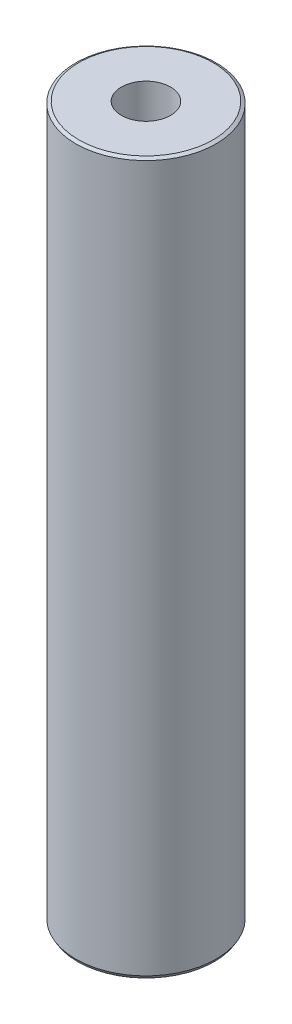
ISO-10303-21;
HEADER;
FILE_DESCRIPTION(('STEP AP214'),'2;1');
FILE_NAME('part.step','',(''),(''),'','','');
FILE_SCHEMA(('AUTOMOTIVE_DESIGN { 1 0 10303 214 1 1 1 1 }'));
ENDSEC;
DATA;
#1=APPLICATION_CONTEXT('core data for automotive mechanical design processes');
#2=APPLICATION_PROTOCOL_DEFINITION('international standard','automotive_design',2000,#1);
#3=PRODUCT_CONTEXT('',#1,'mechanical');
#4=PRODUCT('Part','Part','',(#3));
#5=PRODUCT_RELATED_PRODUCT_CATEGORY('part','',(#4));
#6=PRODUCT_DEFINITION_FORMATION('','',#4);
#7=PRODUCT_DEFINITION_CONTEXT('part definition',#1,'design');
#8=PRODUCT_DEFINITION('design','',#6,#7);
#9=PRODUCT_DEFINITION_SHAPE('','',#8);
#10=(LENGTH_UNIT() NAMED_UNIT(*) SI_UNIT(.MILLI.,.METRE.));
#11=(NAMED_UNIT(*) PLANE_ANGLE_UNIT() SI_UNIT($,.RADIAN.));
#12=(NAMED_UNIT(*) SI_UNIT($,.STERADIAN.) SOLID_ANGLE_UNIT());
#13=UNCERTAINTY_MEASURE_WITH_UNIT(LENGTH_MEASURE(1.E-05),#10,'distance_accuracy_value','');
#14=(GEOMETRIC_REPRESENTATION_CONTEXT(3) GLOBAL_UNCERTAINTY_ASSIGNED_CONTEXT((#13)) GLOBAL_UNIT_ASSIGNED_CONTEXT((#10,
#11,#12)) REPRESENTATION_CONTEXT('',''));
#15=CARTESIAN_POINT('',(0.,0.,0.));
#16=DIRECTION('',(0.,0.,1.));
#17=DIRECTION('',(1.,0.,0.));
#18=AXIS2_PLACEMENT_3D('',#15,#16,#17);
#19=CARTESIAN_POINT('',(0.,531.758512263171,0.));
#20=DIRECTION('',(0.,-1.,0.));
#21=DIRECTION('',(0.,0.,-1.));
#22=AXIS2_PLACEMENT_3D('',#19,#20,#21);
#23=CYLINDRICAL_SURFACE('',#22,52.5);
#24=CARTESIAN_POINT('',(0.,530.400131771963,0.));
#25=DIRECTION('',(0.,1.,0.));
#26=DIRECTION('',(0.,0.,1.));
#27=AXIS2_PLACEMENT_3D('',#24,#25,#26);
#28=CIRCLE('',#27,52.5);
#29=CARTESIAN_POINT('',(0.,530.400131771963,52.5));
#30=VERTEX_POINT('',#29);
#31=EDGE_CURVE('E50',#30,#30,#28,.F.);
#32=ORIENTED_EDGE('',*,*,#31,.T.);
#33=EDGE_LOOP('',(#32));
#34=FACE_BOUND('',#33,.T.);
#35=CARTESIAN_POINT('',(0.,2.35278402678218,0.));
#36=DIRECTION('',(0.,1.,0.));
#37=DIRECTION('',(0.,0.,1.));
#38=AXIS2_PLACEMENT_3D('',#35,#36,#37);
#39=CIRCLE('',#38,52.5);
#40=CARTESIAN_POINT('',(0.,2.35278402678218,52.5));
#41=VERTEX_POINT('',#40);
#42=EDGE_CURVE('E51',#41,#41,#39,.T.);
#43=ORIENTED_EDGE('',*,*,#42,.T.);
#44=EDGE_LOOP('',(#43));
#45=FACE_BOUND('',#44,.T.);
#46=ADVANCED_FACE('F39',(#34,#45),#23,.T.);
#47=CARTESIAN_POINT('',(0.,531.758512263171,0.));
#48=DIRECTION('',(0.,1.,0.));
#49=DIRECTION('',(0.,0.,1.));
#50=AXIS2_PLACEMENT_3D('',#47,#48,#49);
#51=PLANE('',#50);
#52=CARTESIAN_POINT('',(0.,531.758512263171,0.));
#53=DIRECTION('',(0.,1.,0.));
#54=DIRECTION('',(0.,0.,1.));
#55=AXIS2_PLACEMENT_3D('',#52,#53,#54);
#56=CIRCLE('',#55,50.1472159732179);
#57=CARTESIAN_POINT('',(0.,531.758512263171,50.1472159732179));
#58=VERTEX_POINT('',#57);
#59=EDGE_CURVE('E54',#58,#58,#56,.T.);
#60=ORIENTED_EDGE('',*,*,#59,.T.);
#61=EDGE_LOOP('',(#60));
#62=FACE_BOUND('',#61,.T.);
#63=CARTESIAN_POINT('',(0.,531.758512263171,0.));
#64=DIRECTION('',(0.,1.,0.));
#65=DIRECTION('',(0.,0.,1.));
#66=AXIS2_PLACEMENT_3D('',#63,#64,#65);
#67=CIRCLE('',#66,18.4090410865922);
#68=CARTESIAN_POINT('',(0.,531.758512263171,18.4090410865922));
#69=VERTEX_POINT('',#68);
#70=EDGE_CURVE('E58',#69,#69,#67,.T.);
#71=ORIENTED_EDGE('',*,*,#70,.F.);
#72=EDGE_LOOP('',(#71));
#73=FACE_BOUND('',#72,.T.);
#74=ADVANCED_FACE('F69',(#62,#73),#51,.T.);
#75=CARTESIAN_POINT('',(0.,0.,0.));
#76=DIRECTION('',(0.,1.,0.));
#77=DIRECTION('',(0.,0.,1.));
#78=AXIS2_PLACEMENT_3D('',#75,#76,#77);
#79=PLANE('',#78);
#80=CARTESIAN_POINT('',(0.,0.,0.));
#81=DIRECTION('',(0.,1.,0.));
#82=DIRECTION('',(0.,0.,1.));
#83=AXIS2_PLACEMENT_3D('',#80,#81,#82);
#84=CIRCLE('',#83,51.1416195087923);
#85=CARTESIAN_POINT('',(0.,0.,51.1416195087923));
#86=VERTEX_POINT('',#85);
#87=EDGE_CURVE('E10',#86,#86,#84,.F.);
#88=ORIENTED_EDGE('',*,*,#87,.T.);
#89=EDGE_LOOP('',(#88));
#90=FACE_BOUND('',#89,.T.);
#91=CARTESIAN_POINT('',(0.,0.,0.));
#92=DIRECTION('',(0.,1.,0.));
#93=DIRECTION('',(0.,0.,1.));
#94=AXIS2_PLACEMENT_3D('',#91,#92,#93);
#95=CIRCLE('',#94,18.4090410865922);
#96=CARTESIAN_POINT('',(0.,0.,18.4090410865922));
#97=VERTEX_POINT('',#96);
#98=EDGE_CURVE('E63',#97,#97,#95,.T.);
#99=ORIENTED_EDGE('',*,*,#98,.T.);
#100=EDGE_LOOP('',(#99));
#101=FACE_BOUND('',#100,.T.);
#102=ADVANCED_FACE('F75',(#90,#101),#79,.F.);
#103=CARTESIAN_POINT('',(0.,531.758512263171,0.));
#104=DIRECTION('',(0.,-1.,0.));
#105=DIRECTION('',(0.,0.,-1.));
#106=AXIS2_PLACEMENT_3D('',#103,#104,#105);
#107=CYLINDRICAL_SURFACE('',#106,18.4090410865922);
#108=ORIENTED_EDGE('',*,*,#70,.T.);
#109=EDGE_LOOP('',(#108));
#110=FACE_BOUND('',#109,.T.);
#111=ORIENTED_EDGE('',*,*,#98,.F.);
#112=EDGE_LOOP('',(#111));
#113=FACE_BOUND('',#112,.T.);
#114=ADVANCED_FACE('F70',(#110,#113),#107,.F.);
#115=CARTESIAN_POINT('',(0.,531.758512263171,0.));
#116=DIRECTION('',(0.,-1.,0.));
#117=DIRECTION('',(0.,0.,-1.));
#118=AXIS2_PLACEMENT_3D('',#115,#116,#117);
#119=CONICAL_SURFACE('',#118,50.1472159732179,1.04719755119659);
#120=ORIENTED_EDGE('',*,*,#31,.F.);
#121=EDGE_LOOP('',(#120));
#122=FACE_BOUND('',#121,.T.);
#123=ORIENTED_EDGE('',*,*,#59,.F.);
#124=EDGE_LOOP('',(#123));
#125=FACE_BOUND('',#124,.T.);
#126=ADVANCED_FACE('F81',(#122,#125),#119,.T.);
#127=CARTESIAN_POINT('',(0.,2.35278402678218,0.));
#128=DIRECTION('',(0.,1.,0.));
#129=DIRECTION('',(0.,0.,1.));
#130=AXIS2_PLACEMENT_3D('',#127,#128,#129);
#131=CONICAL_SURFACE('',#130,52.5,0.523598775598288);
#132=ORIENTED_EDGE('',*,*,#87,.F.);
#133=EDGE_LOOP('',(#132));
#134=FACE_BOUND('',#133,.T.);
#135=ORIENTED_EDGE('',*,*,#42,.F.);
#136=EDGE_LOOP('',(#135));
#137=FACE_BOUND('',#136,.T.);
#138=ADVANCED_FACE('F45',(#134,#137),#131,.T.);
#139=CLOSED_SHELL('',(#46,#74,#102,#114,#126,#138));
#140=MANIFOLD_SOLID_BREP('B2',#139);
#141=ADVANCED_BREP_SHAPE_REPRESENTATION('',(#18,#140),#14);
#142=SHAPE_DEFINITION_REPRESENTATION(#9,#141);
ENDSEC;
END-ISO-10303-21;
